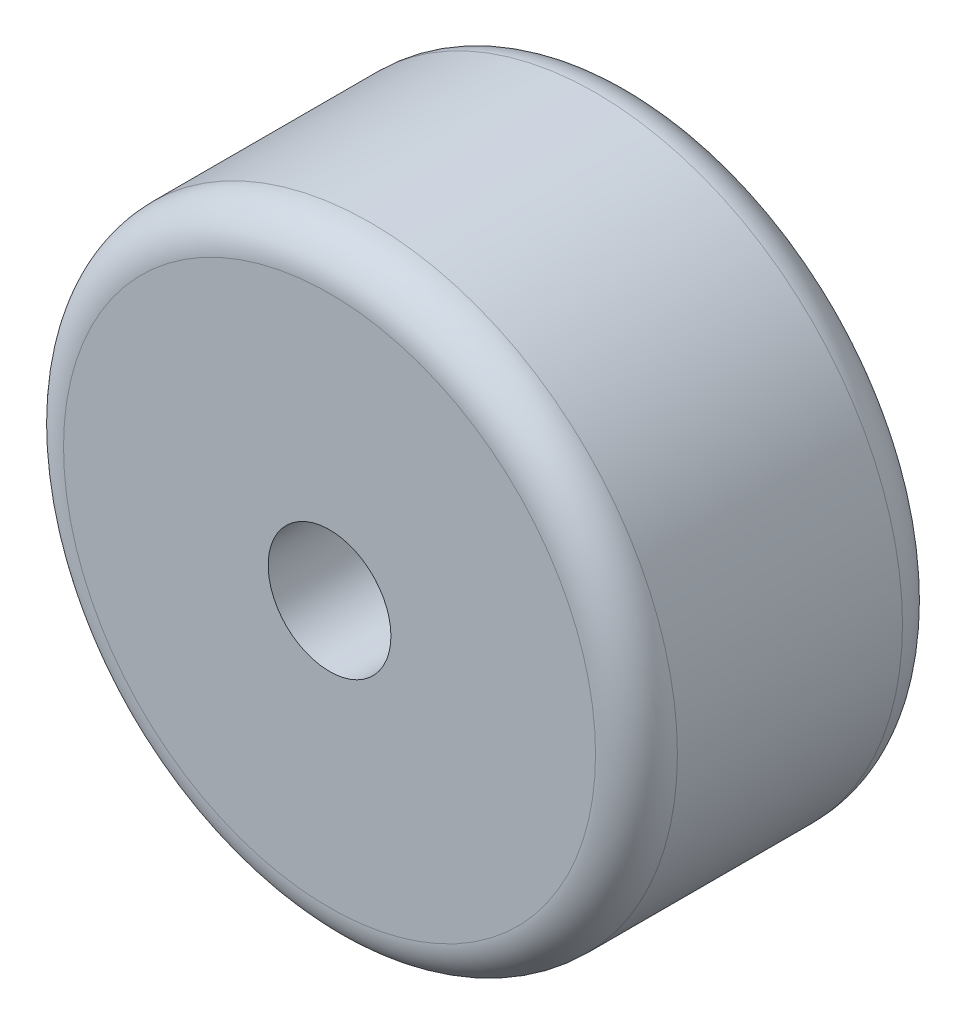
ISO-10303-21;
HEADER;
FILE_DESCRIPTION(('STEP AP214'),'2;1');
FILE_NAME('part.step','',(''),(''),'','','');
FILE_SCHEMA(('AUTOMOTIVE_DESIGN { 1 0 10303 214 1 1 1 1 }'));
ENDSEC;
DATA;
#1=APPLICATION_CONTEXT('core data for automotive mechanical design processes');
#2=APPLICATION_PROTOCOL_DEFINITION('international standard','automotive_design',2000,#1);
#3=PRODUCT_CONTEXT('',#1,'mechanical');
#4=PRODUCT('Part','Part','',(#3));
#5=PRODUCT_RELATED_PRODUCT_CATEGORY('part','',(#4));
#6=PRODUCT_DEFINITION_FORMATION('','',#4);
#7=PRODUCT_DEFINITION_CONTEXT('part definition',#1,'design');
#8=PRODUCT_DEFINITION('design','',#6,#7);
#9=PRODUCT_DEFINITION_SHAPE('','',#8);
#10=(LENGTH_UNIT() NAMED_UNIT(*) SI_UNIT(.MILLI.,.METRE.));
#11=(NAMED_UNIT(*) PLANE_ANGLE_UNIT() SI_UNIT($,.RADIAN.));
#12=(NAMED_UNIT(*) SI_UNIT($,.STERADIAN.) SOLID_ANGLE_UNIT());
#13=UNCERTAINTY_MEASURE_WITH_UNIT(LENGTH_MEASURE(1.E-05),#10,'distance_accuracy_value','');
#14=(GEOMETRIC_REPRESENTATION_CONTEXT(3) GLOBAL_UNCERTAINTY_ASSIGNED_CONTEXT((#13)) GLOBAL_UNIT_ASSIGNED_CONTEXT((#10,
#11,#12)) REPRESENTATION_CONTEXT('',''));
#15=CARTESIAN_POINT('',(0.,0.,0.));
#16=DIRECTION('',(0.,0.,1.));
#17=DIRECTION('',(1.,0.,0.));
#18=AXIS2_PLACEMENT_3D('',#15,#16,#17);
#19=CARTESIAN_POINT('',(0.,0.,150.));
#20=DIRECTION('',(0.,0.,-1.));
#21=DIRECTION('',(-1.,0.,0.));
#22=AXIS2_PLACEMENT_3D('',#19,#20,#21);
#23=CYLINDRICAL_SURFACE('',#22,150.);
#24=CARTESIAN_POINT('',(0.,0.,130.));
#25=DIRECTION('',(0.,0.,1.));
#26=DIRECTION('',(1.,0.,0.));
#27=AXIS2_PLACEMENT_3D('',#24,#25,#26);
#28=CIRCLE('',#27,150.);
#29=CARTESIAN_POINT('',(150.,0.,130.));
#30=VERTEX_POINT('',#29);
#31=EDGE_CURVE('E46',#30,#30,#28,.F.);
#32=ORIENTED_EDGE('',*,*,#31,.T.);
#33=EDGE_LOOP('',(#32));
#34=FACE_BOUND('',#33,.T.);
#35=CARTESIAN_POINT('',(0.,0.,20.));
#36=DIRECTION('',(0.,0.,1.));
#37=DIRECTION('',(1.,0.,0.));
#38=AXIS2_PLACEMENT_3D('',#35,#36,#37);
#39=CIRCLE('',#38,150.);
#40=CARTESIAN_POINT('',(150.,0.,20.));
#41=VERTEX_POINT('',#40);
#42=EDGE_CURVE('E50',#41,#41,#39,.T.);
#43=ORIENTED_EDGE('',*,*,#42,.T.);
#44=EDGE_LOOP('',(#43));
#45=FACE_BOUND('',#44,.T.);
#46=ADVANCED_FACE('F35',(#34,#45),#23,.T.);
#47=CARTESIAN_POINT('',(0.,0.,150.));
#48=DIRECTION('',(0.,0.,1.));
#49=DIRECTION('',(1.,0.,0.));
#50=AXIS2_PLACEMENT_3D('',#47,#48,#49);
#51=PLANE('',#50);
#52=CARTESIAN_POINT('',(0.,0.,150.));
#53=DIRECTION('',(0.,0.,1.));
#54=DIRECTION('',(1.,0.,0.));
#55=AXIS2_PLACEMENT_3D('',#52,#53,#54);
#56=CIRCLE('',#55,130.);
#57=CARTESIAN_POINT('',(130.,0.,150.));
#58=VERTEX_POINT('',#57);
#59=EDGE_CURVE('E55',#58,#58,#56,.T.);
#60=ORIENTED_EDGE('',*,*,#59,.T.);
#61=EDGE_LOOP('',(#60));
#62=FACE_BOUND('',#61,.T.);
#63=CARTESIAN_POINT('',(0.,0.,150.));
#64=DIRECTION('',(0.,0.,1.));
#65=DIRECTION('',(1.,0.,0.));
#66=AXIS2_PLACEMENT_3D('',#63,#64,#65);
#67=CIRCLE('',#66,30.);
#68=CARTESIAN_POINT('',(30.,0.,150.));
#69=VERTEX_POINT('',#68);
#70=EDGE_CURVE('E59',#69,#69,#67,.T.);
#71=ORIENTED_EDGE('',*,*,#70,.F.);
#72=EDGE_LOOP('',(#71));
#73=FACE_BOUND('',#72,.T.);
#74=ADVANCED_FACE('F78',(#62,#73),#51,.T.);
#75=CARTESIAN_POINT('',(0.,0.,0.));
#76=DIRECTION('',(0.,0.,1.));
#77=DIRECTION('',(1.,0.,0.));
#78=AXIS2_PLACEMENT_3D('',#75,#76,#77);
#79=PLANE('',#78);
#80=CARTESIAN_POINT('',(0.,0.,0.));
#81=DIRECTION('',(0.,0.,1.));
#82=DIRECTION('',(1.,0.,0.));
#83=AXIS2_PLACEMENT_3D('',#80,#81,#82);
#84=CIRCLE('',#83,31.7944947177034);
#85=CARTESIAN_POINT('',(31.7944947177034,0.,0.));
#86=VERTEX_POINT('',#85);
#87=EDGE_CURVE('E10',#86,#86,#84,.T.);
#88=ORIENTED_EDGE('',*,*,#87,.T.);
#89=EDGE_LOOP('',(#88));
#90=FACE_BOUND('',#89,.T.);
#91=CARTESIAN_POINT('',(0.,0.,0.));
#92=DIRECTION('',(0.,0.,1.));
#93=DIRECTION('',(1.,0.,0.));
#94=AXIS2_PLACEMENT_3D('',#91,#92,#93);
#95=CIRCLE('',#94,130.);
#96=CARTESIAN_POINT('',(130.,0.,0.));
#97=VERTEX_POINT('',#96);
#98=EDGE_CURVE('E42',#97,#97,#95,.F.);
#99=ORIENTED_EDGE('',*,*,#98,.T.);
#100=EDGE_LOOP('',(#99));
#101=FACE_BOUND('',#100,.T.);
#102=ADVANCED_FACE('F84',(#90,#101),#79,.F.);
#103=CARTESIAN_POINT('',(0.,0.,100.));
#104=DIRECTION('',(0.,0.,1.));
#105=DIRECTION('',(1.,0.,0.));
#106=AXIS2_PLACEMENT_3D('',#103,#104,#105);
#107=CYLINDRICAL_SURFACE('',#106,30.);
#108=CARTESIAN_POINT('',(0.,0.,100.));
#109=DIRECTION('',(0.,0.,1.));
#110=DIRECTION('',(1.,0.,0.));
#111=AXIS2_PLACEMENT_3D('',#108,#109,#110);
#112=CIRCLE('',#111,30.);
#113=CARTESIAN_POINT('',(30.,0.,100.));
#114=VERTEX_POINT('',#113);
#115=EDGE_CURVE('E58',#114,#114,#112,.T.);
#116=ORIENTED_EDGE('',*,*,#115,.F.);
#117=EDGE_LOOP('',(#116));
#118=FACE_BOUND('',#117,.T.);
#119=ORIENTED_EDGE('',*,*,#70,.T.);
#120=EDGE_LOOP('',(#119));
#121=FACE_BOUND('',#120,.T.);
#122=ADVANCED_FACE('F117',(#118,#121),#107,.F.);
#123=CARTESIAN_POINT('',(0.,0.,100.));
#124=DIRECTION('',(0.,0.,1.));
#125=DIRECTION('',(1.,0.,0.));
#126=AXIS2_PLACEMENT_3D('',#123,#124,#125);
#127=PLANE('',#126);
#128=ORIENTED_EDGE('',*,*,#115,.T.);
#129=EDGE_LOOP('',(#128));
#130=FACE_BOUND('',#129,.T.);
#131=ADVANCED_FACE('F92',(#130),#127,.T.);
#132=CARTESIAN_POINT('',(0.,0.,130.));
#133=DIRECTION('',(0.,0.,1.));
#134=DIRECTION('',(1.,0.,0.));
#135=AXIS2_PLACEMENT_3D('',#132,#133,#134);
#136=TOROIDAL_SURFACE('',#135,130.,20.);
#137=ORIENTED_EDGE('',*,*,#31,.F.);
#138=EDGE_LOOP('',(#137));
#139=FACE_BOUND('',#138,.T.);
#140=ORIENTED_EDGE('',*,*,#59,.F.);
#141=EDGE_LOOP('',(#140));
#142=FACE_BOUND('',#141,.T.);
#143=ADVANCED_FACE('F90',(#139,#142),#136,.T.);
#144=CARTESIAN_POINT('',(0.,0.,20.));
#145=DIRECTION('',(0.,0.,1.));
#146=DIRECTION('',(1.,0.,0.));
#147=AXIS2_PLACEMENT_3D('',#144,#145,#146);
#148=TOROIDAL_SURFACE('',#147,130.,20.);
#149=ORIENTED_EDGE('',*,*,#98,.F.);
#150=EDGE_LOOP('',(#149));
#151=FACE_BOUND('',#150,.T.);
#152=ORIENTED_EDGE('',*,*,#42,.F.);
#153=EDGE_LOOP('',(#152));
#154=FACE_BOUND('',#153,.T.);
#155=ADVANCED_FACE('F75',(#151,#154),#148,.T.);
#156=CARTESIAN_POINT('',(0.,0.,5.));
#157=DIRECTION('',(0.,0.,-1.));
#158=DIRECTION('',(-1.,0.,0.));
#159=AXIS2_PLACEMENT_3D('',#156,#157,#158);
#160=PLANE('',#159);
#161=CARTESIAN_POINT('',(0.,0.,5.));
#162=DIRECTION('',(0.,0.,-1.));
#163=DIRECTION('',(-1.,0.,0.));
#164=AXIS2_PLACEMENT_3D('',#161,#162,#163);
#165=CIRCLE('',#164,10.);
#166=CARTESIAN_POINT('',(-10.,0.,5.));
#167=VERTEX_POINT('',#166);
#168=EDGE_CURVE('E62',#167,#167,#165,.T.);
#169=ORIENTED_EDGE('',*,*,#168,.T.);
#170=EDGE_LOOP('',(#169));
#171=FACE_BOUND('',#170,.T.);
#172=ADVANCED_FACE('F68',(#171),#160,.T.);
#173=CARTESIAN_POINT('',(0.,0.,50.));
#174=DIRECTION('',(0.,0.,1.));
#175=DIRECTION('',(1.,0.,0.));
#176=AXIS2_PLACEMENT_3D('',#173,#174,#175);
#177=DEGENERATE_TOROIDAL_SURFACE('',#176,31.7944947177034,50.,.T.);
#178=ORIENTED_EDGE('',*,*,#87,.F.);
#179=EDGE_LOOP('',(#178));
#180=FACE_BOUND('',#179,.T.);
#181=ORIENTED_EDGE('',*,*,#168,.F.);
#182=EDGE_LOOP('',(#181));
#183=FACE_BOUND('',#182,.T.);
#184=ADVANCED_FACE('F37',(#180,#183),#177,.T.);
#185=CLOSED_SHELL('',(#46,#74,#102,#122,#131,#143,#155,#172,#184));
#186=MANIFOLD_SOLID_BREP('B2',#185);
#187=ADVANCED_BREP_SHAPE_REPRESENTATION('',(#18,#186),#14);
#188=SHAPE_DEFINITION_REPRESENTATION(#9,#187);
ENDSEC;
END-ISO-10303-21;
